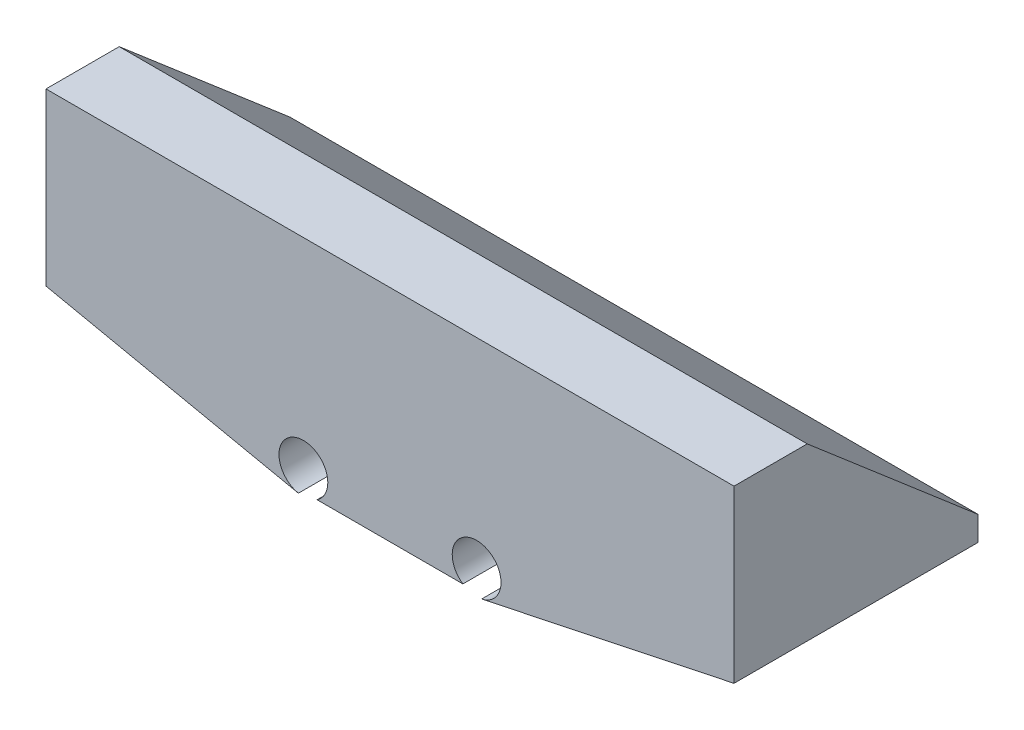
ISO-10303-21;
HEADER;
FILE_DESCRIPTION(('STEP AP214'),'2;1');
FILE_NAME('part.step','',(''),(''),'','','');
FILE_SCHEMA(('AUTOMOTIVE_DESIGN { 1 0 10303 214 1 1 1 1 }'));
ENDSEC;
DATA;
#1=APPLICATION_CONTEXT('core data for automotive mechanical design processes');
#2=APPLICATION_PROTOCOL_DEFINITION('international standard','automotive_design',2000,#1);
#3=PRODUCT_CONTEXT('',#1,'mechanical');
#4=PRODUCT('Part','Part','',(#3));
#5=PRODUCT_RELATED_PRODUCT_CATEGORY('part','',(#4));
#6=PRODUCT_DEFINITION_FORMATION('','',#4);
#7=PRODUCT_DEFINITION_CONTEXT('part definition',#1,'design');
#8=PRODUCT_DEFINITION('design','',#6,#7);
#9=PRODUCT_DEFINITION_SHAPE('','',#8);
#10=(LENGTH_UNIT() NAMED_UNIT(*) SI_UNIT(.MILLI.,.METRE.));
#11=(NAMED_UNIT(*) PLANE_ANGLE_UNIT() SI_UNIT($,.RADIAN.));
#12=(NAMED_UNIT(*) SI_UNIT($,.STERADIAN.) SOLID_ANGLE_UNIT());
#13=UNCERTAINTY_MEASURE_WITH_UNIT(LENGTH_MEASURE(1.E-05),#10,'distance_accuracy_value','');
#14=(GEOMETRIC_REPRESENTATION_CONTEXT(3) GLOBAL_UNCERTAINTY_ASSIGNED_CONTEXT((#13)) GLOBAL_UNIT_ASSIGNED_CONTEXT((#10,
#11,#12)) REPRESENTATION_CONTEXT('',''));
#15=CARTESIAN_POINT('',(0.,0.,0.));
#16=DIRECTION('',(0.,0.,1.));
#17=DIRECTION('',(1.,0.,0.));
#18=AXIS2_PLACEMENT_3D('',#15,#16,#17);
#19=CARTESIAN_POINT('',(17.6931562419829,90.3913509711459,-33.));
#20=DIRECTION('',(0.,0.,1.));
#21=DIRECTION('',(1.,0.,0.));
#22=AXIS2_PLACEMENT_3D('',#19,#20,#21);
#23=CYLINDRICAL_SURFACE('',#22,5.);
#24=CARTESIAN_POINT('',(17.6931562419829,90.3913509711459,17.));
#25=DIRECTION('',(0.,0.,-1.));
#26=DIRECTION('',(1.,0.,0.));
#27=AXIS2_PLACEMENT_3D('',#24,#25,#26);
#28=CIRCLE('',#27,5.);
#29=CARTESIAN_POINT('',(14.8857049099708,86.2539342628141,17.));
#30=VERTEX_POINT('',#29);
#31=CARTESIAN_POINT('',(18.7235767192839,85.4986795495237,17.));
#32=VERTEX_POINT('',#31);
#33=EDGE_CURVE('E131',#30,#32,#28,.T.);
#34=ORIENTED_EDGE('',*,*,#33,.F.);
#35=DIRECTION('',(0.,0.,1.));
#36=VECTOR('',#35,1.);
#37=CARTESIAN_POINT('',(14.8857049099708,86.2539342628141,-33.));
#38=LINE('',#37,#36);
#39=CARTESIAN_POINT('',(14.8857049099708,86.2539342628141,-33.));
#40=VERTEX_POINT('',#39);
#41=EDGE_CURVE('E11',#40,#30,#38,.T.);
#42=ORIENTED_EDGE('',*,*,#41,.F.);
#43=CARTESIAN_POINT('',(17.6931562419829,90.3913509711459,-33.));
#44=DIRECTION('',(0.,0.,-1.));
#45=DIRECTION('',(1.,0.,0.));
#46=AXIS2_PLACEMENT_3D('',#43,#44,#45);
#47=CIRCLE('',#46,5.);
#48=CARTESIAN_POINT('',(18.7235767192839,85.4986795495237,-33.));
#49=VERTEX_POINT('',#48);
#50=EDGE_CURVE('E149',#40,#49,#47,.T.);
#51=ORIENTED_EDGE('',*,*,#50,.T.);
#52=DIRECTION('',(0.,0.,1.));
#53=VECTOR('',#52,1.);
#54=CARTESIAN_POINT('',(18.7235767192839,85.4986795495237,-33.));
#55=LINE('',#54,#53);
#56=EDGE_CURVE('E40',#49,#32,#55,.T.);
#57=ORIENTED_EDGE('',*,*,#56,.T.);
#58=EDGE_LOOP('',(#34,#42,#51,#57));
#59=FACE_BOUND('',#58,.T.);
#60=ADVANCED_FACE('F37',(#59),#23,.F.);
#61=CARTESIAN_POINT('',(-14.9938636439846,86.253934262814,-33.));
#62=DIRECTION('',(0.,-1.,0.));
#63=DIRECTION('',(1.,0.,0.));
#64=AXIS2_PLACEMENT_3D('',#61,#62,#63);
#65=PLANE('',#64);
#66=DIRECTION('',(1.,0.,0.));
#67=VECTOR('',#66,1.);
#68=CARTESIAN_POINT('',(-14.9938636439846,86.253934262814,17.));
#69=LINE('',#68,#67);
#70=CARTESIAN_POINT('',(-14.9938636439846,86.253934262814,17.));
#71=VERTEX_POINT('',#70);
#72=EDGE_CURVE('E147',#71,#30,#69,.T.);
#73=ORIENTED_EDGE('',*,*,#72,.F.);
#74=DIRECTION('',(0.,0.,1.));
#75=VECTOR('',#74,1.);
#76=CARTESIAN_POINT('',(-14.9938636439846,86.253934262814,-33.));
#77=LINE('',#76,#75);
#78=CARTESIAN_POINT('',(-14.9938636439846,86.253934262814,-33.));
#79=VERTEX_POINT('',#78);
#80=EDGE_CURVE('E46',#79,#71,#77,.T.);
#81=ORIENTED_EDGE('',*,*,#80,.F.);
#82=DIRECTION('',(1.,0.,0.));
#83=VECTOR('',#82,1.);
#84=CARTESIAN_POINT('',(-14.9938636439846,86.253934262814,-33.));
#85=LINE('',#84,#83);
#86=EDGE_CURVE('E121',#79,#40,#85,.T.);
#87=ORIENTED_EDGE('',*,*,#86,.T.);
#88=ORIENTED_EDGE('',*,*,#41,.T.);
#89=EDGE_LOOP('',(#73,#81,#87,#88));
#90=FACE_BOUND('',#89,.T.);
#91=ADVANCED_FACE('F157',(#90),#65,.T.);
#92=CARTESIAN_POINT('',(-17.8013149759967,90.3913509711459,-33.));
#93=DIRECTION('',(0.,0.,1.));
#94=DIRECTION('',(1.,0.,0.));
#95=AXIS2_PLACEMENT_3D('',#92,#93,#94);
#96=CYLINDRICAL_SURFACE('',#95,5.00000000000001);
#97=CARTESIAN_POINT('',(-17.8013149759967,90.3913509711459,17.));
#98=DIRECTION('',(0.,0.,-1.));
#99=DIRECTION('',(1.,0.,0.));
#100=AXIS2_PLACEMENT_3D('',#97,#98,#99);
#101=CIRCLE('',#100,5.00000000000001);
#102=CARTESIAN_POINT('',(-18.8317354532976,85.4986795495237,17.));
#103=VERTEX_POINT('',#102);
#104=EDGE_CURVE('E109',#103,#71,#101,.T.);
#105=ORIENTED_EDGE('',*,*,#104,.F.);
#106=DIRECTION('',(0.,0.,1.));
#107=VECTOR('',#106,1.);
#108=CARTESIAN_POINT('',(-18.8317354532976,85.4986795495237,-33.));
#109=LINE('',#108,#107);
#110=CARTESIAN_POINT('',(-18.8317354532976,85.4986795495237,-33.));
#111=VERTEX_POINT('',#110);
#112=EDGE_CURVE('E104',#111,#103,#109,.T.);
#113=ORIENTED_EDGE('',*,*,#112,.F.);
#114=CARTESIAN_POINT('',(-17.8013149759967,90.3913509711459,-33.));
#115=DIRECTION('',(0.,0.,-1.));
#116=DIRECTION('',(1.,0.,0.));
#117=AXIS2_PLACEMENT_3D('',#114,#115,#116);
#118=CIRCLE('',#117,5.00000000000001);
#119=EDGE_CURVE('E107',#111,#79,#118,.T.);
#120=ORIENTED_EDGE('',*,*,#119,.T.);
#121=ORIENTED_EDGE('',*,*,#80,.T.);
#122=EDGE_LOOP('',(#105,#113,#120,#121));
#123=FACE_BOUND('',#122,.T.);
#124=ADVANCED_FACE('F106',(#123),#96,.F.);
#125=CARTESIAN_POINT('',(-70.5526235215241,96.3913509711459,-33.));
#126=DIRECTION('',(-0.206084095460195,-0.978534284324445,0.));
#127=DIRECTION('',(0.978534284324445,-0.206084095460195,0.));
#128=AXIS2_PLACEMENT_3D('',#125,#126,#127);
#129=PLANE('',#128);
#130=DIRECTION('',(0.978534284324445,-0.206084095460195,0.));
#131=VECTOR('',#130,1.);
#132=CARTESIAN_POINT('',(-70.5526235215241,96.3913509711459,17.));
#133=LINE('',#132,#131);
#134=CARTESIAN_POINT('',(-70.5526235215241,96.3913509711459,17.));
#135=VERTEX_POINT('',#134);
#136=EDGE_CURVE('E144',#135,#103,#133,.T.);
#137=ORIENTED_EDGE('',*,*,#136,.F.);
#138=DIRECTION('',(0.,0.,1.));
#139=VECTOR('',#138,1.);
#140=CARTESIAN_POINT('',(-70.5526235215241,96.3913509711459,-33.));
#141=LINE('',#140,#139);
#142=CARTESIAN_POINT('',(-70.5526235215241,96.3913509711459,-33.));
#143=VERTEX_POINT('',#142);
#144=EDGE_CURVE('E114',#143,#135,#141,.T.);
#145=ORIENTED_EDGE('',*,*,#144,.F.);
#146=DIRECTION('',(0.978534284324445,-0.206084095460195,0.));
#147=VECTOR('',#146,1.);
#148=CARTESIAN_POINT('',(-70.5526235215241,96.3913509711459,-33.));
#149=LINE('',#148,#147);
#150=EDGE_CURVE('E119',#143,#111,#149,.T.);
#151=ORIENTED_EDGE('',*,*,#150,.T.);
#152=ORIENTED_EDGE('',*,*,#112,.T.);
#153=EDGE_LOOP('',(#137,#145,#151,#152));
#154=FACE_BOUND('',#153,.T.);
#155=ADVANCED_FACE('F123',(#154),#129,.T.);
#156=CARTESIAN_POINT('',(-70.5526235215241,101.391350971146,-33.));
#157=DIRECTION('',(-1.,0.,0.));
#158=DIRECTION('',(0.,0.,1.));
#159=AXIS2_PLACEMENT_3D('',#156,#157,#158);
#160=PLANE('',#159);
#161=DIRECTION('',(0.,-1.,0.));
#162=VECTOR('',#161,1.);
#163=CARTESIAN_POINT('',(-70.5526235215241,101.391350971146,17.));
#164=LINE('',#163,#162);
#165=CARTESIAN_POINT('',(-70.5526235215241,131.391350971146,17.));
#166=VERTEX_POINT('',#165);
#167=EDGE_CURVE('E141',#166,#135,#164,.T.);
#168=ORIENTED_EDGE('',*,*,#167,.F.);
#169=DIRECTION('',(0.,0.,-1.));
#170=VECTOR('',#169,1.);
#171=CARTESIAN_POINT('',(-70.5526235215241,131.391350971146,17.));
#172=LINE('',#171,#170);
#173=CARTESIAN_POINT('',(-70.5526235215241,131.391350971146,2.));
#174=VERTEX_POINT('',#173);
#175=EDGE_CURVE('E216',#166,#174,#172,.T.);
#176=ORIENTED_EDGE('',*,*,#175,.T.);
#177=DIRECTION('',(0.,-0.650791373455969,-0.759256602365296));
#178=VECTOR('',#177,1.);
#179=CARTESIAN_POINT('',(-70.5526235215241,131.391350971146,2.));
#180=LINE('',#179,#178);
#181=CARTESIAN_POINT('',(-70.5526235215241,101.391350971146,-33.));
#182=VERTEX_POINT('',#181);
#183=EDGE_CURVE('E206',#174,#182,#180,.T.);
#184=ORIENTED_EDGE('',*,*,#183,.T.);
#185=DIRECTION('',(0.,-1.,0.));
#186=VECTOR('',#185,1.);
#187=CARTESIAN_POINT('',(-70.5526235215241,101.391350971146,-33.));
#188=LINE('',#187,#186);
#189=EDGE_CURVE('E124',#182,#143,#188,.T.);
#190=ORIENTED_EDGE('',*,*,#189,.T.);
#191=ORIENTED_EDGE('',*,*,#144,.T.);
#192=EDGE_LOOP('',(#168,#176,#184,#190,#191));
#193=FACE_BOUND('',#192,.T.);
#194=ADVANCED_FACE('F170',(#193),#160,.T.);
#195=CARTESIAN_POINT('',(70.4444647875104,101.391350971146,-33.));
#196=DIRECTION('',(1.,0.,0.));
#197=DIRECTION('',(0.,0.,-1.));
#198=AXIS2_PLACEMENT_3D('',#195,#196,#197);
#199=PLANE('',#198);
#200=DIRECTION('',(0.,1.,0.));
#201=VECTOR('',#200,1.);
#202=CARTESIAN_POINT('',(70.4444647875104,101.391350971146,17.));
#203=LINE('',#202,#201);
#204=CARTESIAN_POINT('',(70.4444647875104,96.3913509711459,17.));
#205=VERTEX_POINT('',#204);
#206=CARTESIAN_POINT('',(70.4444647875104,131.391350971146,17.));
#207=VERTEX_POINT('',#206);
#208=EDGE_CURVE('E138',#205,#207,#203,.T.);
#209=ORIENTED_EDGE('',*,*,#208,.F.);
#210=DIRECTION('',(0.,0.,1.));
#211=VECTOR('',#210,1.);
#212=CARTESIAN_POINT('',(70.4444647875104,96.3913509711459,-33.));
#213=LINE('',#212,#211);
#214=CARTESIAN_POINT('',(70.4444647875104,96.3913509711459,-33.));
#215=VERTEX_POINT('',#214);
#216=EDGE_CURVE('E152',#215,#205,#213,.T.);
#217=ORIENTED_EDGE('',*,*,#216,.F.);
#218=DIRECTION('',(0.,1.,0.));
#219=VECTOR('',#218,1.);
#220=CARTESIAN_POINT('',(70.4444647875104,101.391350971146,-33.));
#221=LINE('',#220,#219);
#222=CARTESIAN_POINT('',(70.4444647875104,101.391350971146,-33.));
#223=VERTEX_POINT('',#222);
#224=EDGE_CURVE('E224',#215,#223,#221,.T.);
#225=ORIENTED_EDGE('',*,*,#224,.T.);
#226=DIRECTION('',(0.,-0.650791373455969,-0.759256602365297));
#227=VECTOR('',#226,1.);
#228=CARTESIAN_POINT('',(70.4444647875104,131.391350971146,2.));
#229=LINE('',#228,#227);
#230=CARTESIAN_POINT('',(70.4444647875104,131.391350971146,2.));
#231=VERTEX_POINT('',#230);
#232=EDGE_CURVE('E135',#231,#223,#229,.T.);
#233=ORIENTED_EDGE('',*,*,#232,.F.);
#234=DIRECTION('',(0.,0.,-1.));
#235=VECTOR('',#234,1.);
#236=CARTESIAN_POINT('',(70.4444647875104,131.391350971146,17.));
#237=LINE('',#236,#235);
#238=EDGE_CURVE('E209',#207,#231,#237,.T.);
#239=ORIENTED_EDGE('',*,*,#238,.F.);
#240=EDGE_LOOP('',(#209,#217,#225,#233,#239));
#241=FACE_BOUND('',#240,.T.);
#242=ADVANCED_FACE('F173',(#241),#199,.T.);
#243=CARTESIAN_POINT('',(70.4444647875104,96.3913509711459,-33.));
#244=DIRECTION('',(0.206084095460195,-0.978534284324445,0.));
#245=DIRECTION('',(0.978534284324445,0.206084095460195,0.));
#246=AXIS2_PLACEMENT_3D('',#243,#244,#245);
#247=PLANE('',#246);
#248=DIRECTION('',(0.978534284324445,0.206084095460195,0.));
#249=VECTOR('',#248,1.);
#250=CARTESIAN_POINT('',(70.4444647875104,96.3913509711459,17.));
#251=LINE('',#250,#249);
#252=EDGE_CURVE('E134',#32,#205,#251,.T.);
#253=ORIENTED_EDGE('',*,*,#252,.F.);
#254=ORIENTED_EDGE('',*,*,#56,.F.);
#255=DIRECTION('',(0.978534284324445,0.206084095460195,0.));
#256=VECTOR('',#255,1.);
#257=CARTESIAN_POINT('',(70.4444647875104,96.3913509711459,-33.));
#258=LINE('',#257,#256);
#259=EDGE_CURVE('E222',#49,#215,#258,.T.);
#260=ORIENTED_EDGE('',*,*,#259,.T.);
#261=ORIENTED_EDGE('',*,*,#216,.T.);
#262=EDGE_LOOP('',(#253,#254,#260,#261));
#263=FACE_BOUND('',#262,.T.);
#264=ADVANCED_FACE('F154',(#263),#247,.T.);
#265=CARTESIAN_POINT('',(17.6931562419829,90.3913509711459,-33.));
#266=DIRECTION('',(0.,0.,1.));
#267=DIRECTION('',(1.,0.,0.));
#268=AXIS2_PLACEMENT_3D('',#265,#266,#267);
#269=PLANE('',#268);
#270=ORIENTED_EDGE('',*,*,#50,.F.);
#271=ORIENTED_EDGE('',*,*,#86,.F.);
#272=ORIENTED_EDGE('',*,*,#119,.F.);
#273=ORIENTED_EDGE('',*,*,#150,.F.);
#274=ORIENTED_EDGE('',*,*,#189,.F.);
#275=DIRECTION('',(-1.,0.,0.));
#276=VECTOR('',#275,1.);
#277=CARTESIAN_POINT('',(-70.5526235215241,101.391350971146,-33.));
#278=LINE('',#277,#276);
#279=EDGE_CURVE('E126',#223,#182,#278,.T.);
#280=ORIENTED_EDGE('',*,*,#279,.F.);
#281=ORIENTED_EDGE('',*,*,#224,.F.);
#282=ORIENTED_EDGE('',*,*,#259,.F.);
#283=EDGE_LOOP('',(#270,#271,#272,#273,#274,#280,#281,#282));
#284=FACE_BOUND('',#283,.T.);
#285=ADVANCED_FACE('F118',(#284),#269,.F.);
#286=CARTESIAN_POINT('',(17.6931562419829,90.3913509711459,17.));
#287=DIRECTION('',(0.,0.,1.));
#288=DIRECTION('',(1.,0.,0.));
#289=AXIS2_PLACEMENT_3D('',#286,#287,#288);
#290=PLANE('',#289);
#291=ORIENTED_EDGE('',*,*,#33,.T.);
#292=ORIENTED_EDGE('',*,*,#252,.T.);
#293=ORIENTED_EDGE('',*,*,#208,.T.);
#294=DIRECTION('',(-1.,0.,0.));
#295=VECTOR('',#294,1.);
#296=CARTESIAN_POINT('',(128.753983735963,131.391350971146,17.));
#297=LINE('',#296,#295);
#298=EDGE_CURVE('E214',#207,#166,#297,.T.);
#299=ORIENTED_EDGE('',*,*,#298,.T.);
#300=ORIENTED_EDGE('',*,*,#167,.T.);
#301=ORIENTED_EDGE('',*,*,#136,.T.);
#302=ORIENTED_EDGE('',*,*,#104,.T.);
#303=ORIENTED_EDGE('',*,*,#72,.T.);
#304=EDGE_LOOP('',(#291,#292,#293,#299,#300,#301,#302,#303));
#305=FACE_BOUND('',#304,.T.);
#306=ADVANCED_FACE('F156',(#305),#290,.T.);
#307=CARTESIAN_POINT('',(128.753983735963,131.391350971146,17.));
#308=DIRECTION('',(0.,1.,0.));
#309=DIRECTION('',(0.,0.,1.));
#310=AXIS2_PLACEMENT_3D('',#307,#308,#309);
#311=PLANE('',#310);
#312=ORIENTED_EDGE('',*,*,#298,.F.);
#313=ORIENTED_EDGE('',*,*,#238,.T.);
#314=DIRECTION('',(-1.,0.,0.));
#315=VECTOR('',#314,1.);
#316=CARTESIAN_POINT('',(128.753983735963,131.391350971146,2.));
#317=LINE('',#316,#315);
#318=EDGE_CURVE('E201',#231,#174,#317,.T.);
#319=ORIENTED_EDGE('',*,*,#318,.T.);
#320=ORIENTED_EDGE('',*,*,#175,.F.);
#321=EDGE_LOOP('',(#312,#313,#319,#320));
#322=FACE_BOUND('',#321,.T.);
#323=ADVANCED_FACE('F186',(#322),#311,.T.);
#324=CARTESIAN_POINT('',(128.753983735963,131.391350971146,2.));
#325=DIRECTION('',(0.,0.759256602365297,-0.650791373455969));
#326=DIRECTION('',(0.,0.650791373455969,0.759256602365297));
#327=AXIS2_PLACEMENT_3D('',#324,#325,#326);
#328=PLANE('',#327);
#329=ORIENTED_EDGE('',*,*,#318,.F.);
#330=ORIENTED_EDGE('',*,*,#232,.T.);
#331=ORIENTED_EDGE('',*,*,#279,.T.);
#332=ORIENTED_EDGE('',*,*,#183,.F.);
#333=EDGE_LOOP('',(#329,#330,#331,#332));
#334=FACE_BOUND('',#333,.T.);
#335=ADVANCED_FACE('F190',(#334),#328,.T.);
#336=CLOSED_SHELL('',(#60,#91,#124,#155,#194,#242,#264,#285,#306,#323,#335));
#337=MANIFOLD_SOLID_BREP('B2',#336);
#338=ADVANCED_BREP_SHAPE_REPRESENTATION('',(#18,#337),#14);
#339=SHAPE_DEFINITION_REPRESENTATION(#9,#338);
ENDSEC;
END-ISO-10303-21;
